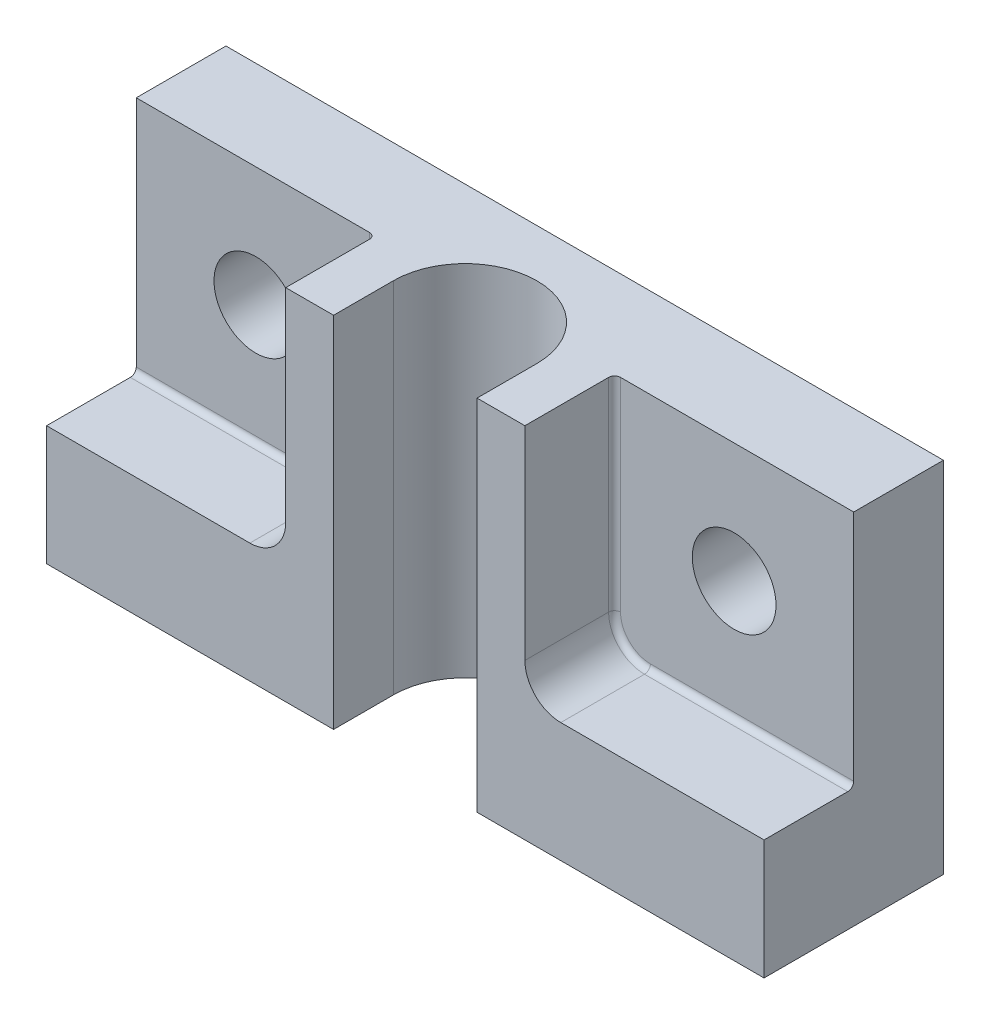
ISO-10303-21;
HEADER;
FILE_DESCRIPTION(('STEP AP214'),'2;1');
FILE_NAME('part.step','',(''),(''),'','','');
FILE_SCHEMA(('AUTOMOTIVE_DESIGN { 1 0 10303 214 1 1 1 1 }'));
ENDSEC;
DATA;
#1=APPLICATION_CONTEXT('core data for automotive mechanical design processes');
#2=APPLICATION_PROTOCOL_DEFINITION('international standard','automotive_design',2000,#1);
#3=PRODUCT_CONTEXT('',#1,'mechanical');
#4=PRODUCT('Part','Part','',(#3));
#5=PRODUCT_RELATED_PRODUCT_CATEGORY('part','',(#4));
#6=PRODUCT_DEFINITION_FORMATION('','',#4);
#7=PRODUCT_DEFINITION_CONTEXT('part definition',#1,'design');
#8=PRODUCT_DEFINITION('design','',#6,#7);
#9=PRODUCT_DEFINITION_SHAPE('','',#8);
#10=(LENGTH_UNIT() NAMED_UNIT(*) SI_UNIT(.MILLI.,.METRE.));
#11=(NAMED_UNIT(*) PLANE_ANGLE_UNIT() SI_UNIT($,.RADIAN.));
#12=(NAMED_UNIT(*) SI_UNIT($,.STERADIAN.) SOLID_ANGLE_UNIT());
#13=UNCERTAINTY_MEASURE_WITH_UNIT(LENGTH_MEASURE(1.E-05),#10,'distance_accuracy_value','');
#14=(GEOMETRIC_REPRESENTATION_CONTEXT(3) GLOBAL_UNCERTAINTY_ASSIGNED_CONTEXT((#13)) GLOBAL_UNIT_ASSIGNED_CONTEXT((#10,
#11,#12)) REPRESENTATION_CONTEXT('',''));
#15=CARTESIAN_POINT('',(0.,0.,0.));
#16=DIRECTION('',(0.,0.,1.));
#17=DIRECTION('',(1.,0.,0.));
#18=AXIS2_PLACEMENT_3D('',#15,#16,#17);
#19=CARTESIAN_POINT('',(-30.,-30.,0.));
#20=DIRECTION('',(0.,0.,1.));
#21=DIRECTION('',(1.,0.,0.));
#22=AXIS2_PLACEMENT_3D('',#19,#20,#21);
#23=PLANE('',#22);
#24=DIRECTION('',(0.,1.,0.));
#25=VECTOR('',#24,1.);
#26=CARTESIAN_POINT('',(-6.,-30.,0.));
#27=LINE('',#26,#25);
#28=CARTESIAN_POINT('',(-6.,-30.,0.));
#29=VERTEX_POINT('',#28);
#30=CARTESIAN_POINT('',(-6.,0.,0.));
#31=VERTEX_POINT('',#30);
#32=EDGE_CURVE('E213',#29,#31,#27,.T.);
#33=ORIENTED_EDGE('',*,*,#32,.T.);
#34=DIRECTION('',(-1.,0.,0.));
#35=VECTOR('',#34,1.);
#36=CARTESIAN_POINT('',(-30.,0.,0.));
#37=LINE('',#36,#35);
#38=CARTESIAN_POINT('',(-10.,0.,0.));
#39=VERTEX_POINT('',#38);
#40=EDGE_CURVE('E292',#31,#39,#37,.T.);
#41=ORIENTED_EDGE('',*,*,#40,.T.);
#42=DIRECTION('',(0.,1.,0.));
#43=VECTOR('',#42,1.);
#44=CARTESIAN_POINT('',(-10.,-17.,0.));
#45=LINE('',#44,#43);
#46=CARTESIAN_POINT('',(-10.,-17.,0.));
#47=VERTEX_POINT('',#46);
#48=EDGE_CURVE('E228',#47,#39,#45,.T.);
#49=ORIENTED_EDGE('',*,*,#48,.F.);
#50=CARTESIAN_POINT('',(-13.,-17.,0.));
#51=DIRECTION('',(0.,0.,1.));
#52=DIRECTION('',(1.,0.,0.));
#53=AXIS2_PLACEMENT_3D('',#50,#51,#52);
#54=CIRCLE('',#53,3.);
#55=CARTESIAN_POINT('',(-13.,-20.,0.));
#56=VERTEX_POINT('',#55);
#57=EDGE_CURVE('E216',#56,#47,#54,.T.);
#58=ORIENTED_EDGE('',*,*,#57,.F.);
#59=DIRECTION('',(1.,0.,0.));
#60=VECTOR('',#59,1.);
#61=CARTESIAN_POINT('',(-13.,-20.,0.));
#62=LINE('',#61,#60);
#63=CARTESIAN_POINT('',(-30.,-20.,0.));
#64=VERTEX_POINT('',#63);
#65=EDGE_CURVE('E222',#64,#56,#62,.T.);
#66=ORIENTED_EDGE('',*,*,#65,.F.);
#67=DIRECTION('',(0.,-1.,0.));
#68=VECTOR('',#67,1.);
#69=CARTESIAN_POINT('',(-30.,0.,0.));
#70=LINE('',#69,#68);
#71=CARTESIAN_POINT('',(-30.,-30.,0.));
#72=VERTEX_POINT('',#71);
#73=EDGE_CURVE('E270',#64,#72,#70,.T.);
#74=ORIENTED_EDGE('',*,*,#73,.T.);
#75=DIRECTION('',(1.,0.,0.));
#76=VECTOR('',#75,1.);
#77=CARTESIAN_POINT('',(-30.,-30.,0.));
#78=LINE('',#77,#76);
#79=EDGE_CURVE('E286',#72,#29,#78,.T.);
#80=ORIENTED_EDGE('',*,*,#79,.T.);
#81=EDGE_LOOP('',(#33,#41,#49,#58,#66,#74,#80));
#82=FACE_BOUND('',#81,.T.);
#83=ADVANCED_FACE('F40',(#82),#23,.T.);
#84=CARTESIAN_POINT('',(-20.,-10.0000000000003,-15.));
#85=DIRECTION('',(0.,0.,1.));
#86=DIRECTION('',(1.,0.,0.));
#87=AXIS2_PLACEMENT_3D('',#84,#85,#86);
#88=CYLINDRICAL_SURFACE('',#87,3.5);
#89=CARTESIAN_POINT('',(-20.,-10.0000000000003,-15.));
#90=DIRECTION('',(0.,0.,1.));
#91=DIRECTION('',(1.,0.,0.));
#92=AXIS2_PLACEMENT_3D('',#89,#90,#91);
#93=CIRCLE('',#92,3.5);
#94=CARTESIAN_POINT('',(-16.5,-10.0000000000003,-15.));
#95=VERTEX_POINT('',#94);
#96=EDGE_CURVE('E264',#95,#95,#93,.T.);
#97=ORIENTED_EDGE('',*,*,#96,.F.);
#98=EDGE_LOOP('',(#97));
#99=FACE_BOUND('',#98,.T.);
#100=CARTESIAN_POINT('',(-20.,-10.0000000000003,-7.5));
#101=DIRECTION('',(0.,0.,1.));
#102=DIRECTION('',(1.,0.,0.));
#103=AXIS2_PLACEMENT_3D('',#100,#101,#102);
#104=CIRCLE('',#103,3.5);
#105=CARTESIAN_POINT('',(-16.5,-10.0000000000003,-7.5));
#106=VERTEX_POINT('',#105);
#107=EDGE_CURVE('E235',#106,#106,#104,.F.);
#108=ORIENTED_EDGE('',*,*,#107,.F.);
#109=EDGE_LOOP('',(#108));
#110=FACE_BOUND('',#109,.T.);
#111=ADVANCED_FACE('F436',(#99,#110),#88,.F.);
#112=CARTESIAN_POINT('',(-30.,0.,-15.));
#113=DIRECTION('',(-1.,0.,0.));
#114=DIRECTION('',(0.,-1.,0.));
#115=AXIS2_PLACEMENT_3D('',#112,#113,#114);
#116=PLANE('',#115);
#117=DIRECTION('',(0.,0.,1.));
#118=VECTOR('',#117,1.);
#119=CARTESIAN_POINT('',(-30.,-20.,-7.5));
#120=LINE('',#119,#118);
#121=CARTESIAN_POINT('',(-30.,-20.,-7.));
#122=VERTEX_POINT('',#121);
#123=EDGE_CURVE('E236',#122,#64,#120,.T.);
#124=ORIENTED_EDGE('',*,*,#123,.F.);
#125=CARTESIAN_POINT('',(-30.,-19.5,-7.));
#126=DIRECTION('',(-1.,0.,0.));
#127=DIRECTION('',(0.,-1.,0.));
#128=AXIS2_PLACEMENT_3D('',#125,#126,#127);
#129=CIRCLE('',#128,0.5);
#130=CARTESIAN_POINT('',(-30.,-19.5,-7.5));
#131=VERTEX_POINT('',#130);
#132=EDGE_CURVE('E49',#122,#131,#129,.F.);
#133=ORIENTED_EDGE('',*,*,#132,.T.);
#134=DIRECTION('',(0.,-1.,0.));
#135=VECTOR('',#134,1.);
#136=CARTESIAN_POINT('',(-30.,-20.,-7.5));
#137=LINE('',#136,#135);
#138=CARTESIAN_POINT('',(-30.,0.,-7.5));
#139=VERTEX_POINT('',#138);
#140=EDGE_CURVE('E221',#139,#131,#137,.T.);
#141=ORIENTED_EDGE('',*,*,#140,.F.);
#142=DIRECTION('',(0.,0.,1.));
#143=VECTOR('',#142,1.);
#144=CARTESIAN_POINT('',(-30.,0.,-15.));
#145=LINE('',#144,#143);
#146=CARTESIAN_POINT('',(-30.,0.,-15.));
#147=VERTEX_POINT('',#146);
#148=EDGE_CURVE('E295',#147,#139,#145,.T.);
#149=ORIENTED_EDGE('',*,*,#148,.F.);
#150=DIRECTION('',(0.,-1.,0.));
#151=VECTOR('',#150,1.);
#152=CARTESIAN_POINT('',(-30.,0.,-15.));
#153=LINE('',#152,#151);
#154=CARTESIAN_POINT('',(-30.,-30.,-15.));
#155=VERTEX_POINT('',#154);
#156=EDGE_CURVE('E271',#147,#155,#153,.T.);
#157=ORIENTED_EDGE('',*,*,#156,.T.);
#158=DIRECTION('',(0.,0.,1.));
#159=VECTOR('',#158,1.);
#160=CARTESIAN_POINT('',(-30.,-30.,-15.));
#161=LINE('',#160,#159);
#162=EDGE_CURVE('E284',#155,#72,#161,.T.);
#163=ORIENTED_EDGE('',*,*,#162,.T.);
#164=ORIENTED_EDGE('',*,*,#73,.F.);
#165=EDGE_LOOP('',(#124,#133,#141,#149,#157,#163,#164));
#166=FACE_BOUND('',#165,.T.);
#167=ADVANCED_FACE('F391',(#166),#116,.T.);
#168=CARTESIAN_POINT('',(-30.,0.,-15.));
#169=DIRECTION('',(0.,1.,0.));
#170=DIRECTION('',(0.,0.,1.));
#171=AXIS2_PLACEMENT_3D('',#168,#169,#170);
#172=PLANE('',#171);
#173=DIRECTION('',(0.,0.,1.));
#174=VECTOR('',#173,1.);
#175=CARTESIAN_POINT('',(-6.,0.,0.));
#176=LINE('',#175,#174);
#177=CARTESIAN_POINT('',(-6.,0.,-5.));
#178=VERTEX_POINT('',#177);
#179=EDGE_CURVE('E204',#178,#31,#176,.T.);
#180=ORIENTED_EDGE('',*,*,#179,.F.);
#181=CARTESIAN_POINT('',(0.,0.,-5.));
#182=DIRECTION('',(0.,1.,0.));
#183=DIRECTION('',(0.,0.,1.));
#184=AXIS2_PLACEMENT_3D('',#181,#182,#183);
#185=CIRCLE('',#184,6.);
#186=CARTESIAN_POINT('',(6.,0.,-5.));
#187=VERTEX_POINT('',#186);
#188=EDGE_CURVE('E206',#187,#178,#185,.T.);
#189=ORIENTED_EDGE('',*,*,#188,.F.);
#190=DIRECTION('',(0.,0.,-1.));
#191=VECTOR('',#190,1.);
#192=CARTESIAN_POINT('',(6.,0.,0.));
#193=LINE('',#192,#191);
#194=CARTESIAN_POINT('',(6.,0.,0.));
#195=VERTEX_POINT('',#194);
#196=EDGE_CURVE('E185',#195,#187,#193,.T.);
#197=ORIENTED_EDGE('',*,*,#196,.F.);
#198=CARTESIAN_POINT('',(10.,0.,0.));
#199=VERTEX_POINT('',#198);
#200=EDGE_CURVE('E275',#199,#195,#37,.T.);
#201=ORIENTED_EDGE('',*,*,#200,.F.);
#202=DIRECTION('',(0.,0.,1.));
#203=VECTOR('',#202,1.);
#204=CARTESIAN_POINT('',(10.,0.,-7.5));
#205=LINE('',#204,#203);
#206=CARTESIAN_POINT('',(10.,0.,-7.));
#207=VERTEX_POINT('',#206);
#208=EDGE_CURVE('E247',#207,#199,#205,.T.);
#209=ORIENTED_EDGE('',*,*,#208,.F.);
#210=CARTESIAN_POINT('',(10.5,0.,-7.));
#211=DIRECTION('',(0.,1.,0.));
#212=DIRECTION('',(0.,0.,1.));
#213=AXIS2_PLACEMENT_3D('',#210,#211,#212);
#214=CIRCLE('',#213,0.5);
#215=CARTESIAN_POINT('',(10.5,0.,-7.5));
#216=VERTEX_POINT('',#215);
#217=EDGE_CURVE('E336',#207,#216,#214,.F.);
#218=ORIENTED_EDGE('',*,*,#217,.T.);
#219=DIRECTION('',(-1.,0.,0.));
#220=VECTOR('',#219,1.);
#221=CARTESIAN_POINT('',(10.,0.,-7.5));
#222=LINE('',#221,#220);
#223=CARTESIAN_POINT('',(30.,0.,-7.5));
#224=VERTEX_POINT('',#223);
#225=EDGE_CURVE('E243',#224,#216,#222,.T.);
#226=ORIENTED_EDGE('',*,*,#225,.F.);
#227=DIRECTION('',(0.,0.,1.));
#228=VECTOR('',#227,1.);
#229=CARTESIAN_POINT('',(30.,0.,-15.));
#230=LINE('',#229,#228);
#231=CARTESIAN_POINT('',(30.,0.,-15.));
#232=VERTEX_POINT('',#231);
#233=EDGE_CURVE('E299',#232,#224,#230,.T.);
#234=ORIENTED_EDGE('',*,*,#233,.F.);
#235=DIRECTION('',(-1.,0.,0.));
#236=VECTOR('',#235,1.);
#237=CARTESIAN_POINT('',(-30.,0.,-15.));
#238=LINE('',#237,#236);
#239=EDGE_CURVE('E281',#232,#147,#238,.T.);
#240=ORIENTED_EDGE('',*,*,#239,.T.);
#241=ORIENTED_EDGE('',*,*,#148,.T.);
#242=DIRECTION('',(-1.,0.,0.));
#243=VECTOR('',#242,1.);
#244=CARTESIAN_POINT('',(-10.,0.,-7.5));
#245=LINE('',#244,#243);
#246=CARTESIAN_POINT('',(-10.5,0.,-7.5));
#247=VERTEX_POINT('',#246);
#248=EDGE_CURVE('E219',#247,#139,#245,.T.);
#249=ORIENTED_EDGE('',*,*,#248,.F.);
#250=CARTESIAN_POINT('',(-10.5,0.,-7.));
#251=DIRECTION('',(0.,1.,0.));
#252=DIRECTION('',(0.,0.,1.));
#253=AXIS2_PLACEMENT_3D('',#250,#251,#252);
#254=CIRCLE('',#253,0.5);
#255=CARTESIAN_POINT('',(-10.,0.,-7.));
#256=VERTEX_POINT('',#255);
#257=EDGE_CURVE('E334',#247,#256,#254,.F.);
#258=ORIENTED_EDGE('',*,*,#257,.T.);
#259=DIRECTION('',(0.,0.,1.));
#260=VECTOR('',#259,1.);
#261=CARTESIAN_POINT('',(-10.,0.,-7.5));
#262=LINE('',#261,#260);
#263=EDGE_CURVE('E238',#256,#39,#262,.T.);
#264=ORIENTED_EDGE('',*,*,#263,.T.);
#265=ORIENTED_EDGE('',*,*,#40,.F.);
#266=EDGE_LOOP('',(#180,#189,#197,#201,#209,#218,#226,#234,#240,#241,#249,#258,#264,#265));
#267=FACE_BOUND('',#266,.T.);
#268=ADVANCED_FACE('F366',(#267),#172,.T.);
#269=CARTESIAN_POINT('',(30.,0.,-15.));
#270=DIRECTION('',(1.,0.,0.));
#271=DIRECTION('',(0.,1.,0.));
#272=AXIS2_PLACEMENT_3D('',#269,#270,#271);
#273=PLANE('',#272);
#274=DIRECTION('',(0.,1.,0.));
#275=VECTOR('',#274,1.);
#276=CARTESIAN_POINT('',(30.,-20.,-7.5));
#277=LINE('',#276,#275);
#278=CARTESIAN_POINT('',(30.,-19.5,-7.5));
#279=VERTEX_POINT('',#278);
#280=EDGE_CURVE('E241',#279,#224,#277,.T.);
#281=ORIENTED_EDGE('',*,*,#280,.F.);
#282=CARTESIAN_POINT('',(30.,-19.5,-7.));
#283=DIRECTION('',(1.,0.,0.));
#284=DIRECTION('',(0.,1.,0.));
#285=AXIS2_PLACEMENT_3D('',#282,#283,#284);
#286=CIRCLE('',#285,0.5);
#287=CARTESIAN_POINT('',(30.,-20.,-7.));
#288=VERTEX_POINT('',#287);
#289=EDGE_CURVE('E11',#279,#288,#286,.F.);
#290=ORIENTED_EDGE('',*,*,#289,.T.);
#291=DIRECTION('',(0.,0.,1.));
#292=VECTOR('',#291,1.);
#293=CARTESIAN_POINT('',(30.,-20.,-7.5));
#294=LINE('',#293,#292);
#295=CARTESIAN_POINT('',(30.,-20.,0.));
#296=VERTEX_POINT('',#295);
#297=EDGE_CURVE('E256',#288,#296,#294,.T.);
#298=ORIENTED_EDGE('',*,*,#297,.T.);
#299=DIRECTION('',(0.,1.,0.));
#300=VECTOR('',#299,1.);
#301=CARTESIAN_POINT('',(30.,0.,0.));
#302=LINE('',#301,#300);
#303=CARTESIAN_POINT('',(30.,-30.,0.));
#304=VERTEX_POINT('',#303);
#305=EDGE_CURVE('E289',#304,#296,#302,.T.);
#306=ORIENTED_EDGE('',*,*,#305,.F.);
#307=DIRECTION('',(0.,0.,1.));
#308=VECTOR('',#307,1.);
#309=CARTESIAN_POINT('',(30.,-30.,-15.));
#310=LINE('',#309,#308);
#311=CARTESIAN_POINT('',(30.,-30.,-15.));
#312=VERTEX_POINT('',#311);
#313=EDGE_CURVE('E302',#312,#304,#310,.T.);
#314=ORIENTED_EDGE('',*,*,#313,.F.);
#315=DIRECTION('',(0.,1.,0.));
#316=VECTOR('',#315,1.);
#317=CARTESIAN_POINT('',(30.,0.,-15.));
#318=LINE('',#317,#316);
#319=EDGE_CURVE('E278',#312,#232,#318,.T.);
#320=ORIENTED_EDGE('',*,*,#319,.T.);
#321=ORIENTED_EDGE('',*,*,#233,.T.);
#322=EDGE_LOOP('',(#281,#290,#298,#306,#314,#320,#321));
#323=FACE_BOUND('',#322,.T.);
#324=ADVANCED_FACE('F361',(#323),#273,.T.);
#325=CARTESIAN_POINT('',(-30.,-30.,-15.));
#326=DIRECTION('',(0.,-1.,0.));
#327=DIRECTION('',(0.,0.,-1.));
#328=AXIS2_PLACEMENT_3D('',#325,#326,#327);
#329=PLANE('',#328);
#330=DIRECTION('',(0.,0.,1.));
#331=VECTOR('',#330,1.);
#332=CARTESIAN_POINT('',(-6.,-30.,0.));
#333=LINE('',#332,#331);
#334=CARTESIAN_POINT('',(-6.,-30.,-5.));
#335=VERTEX_POINT('',#334);
#336=EDGE_CURVE('E198',#335,#29,#333,.T.);
#337=ORIENTED_EDGE('',*,*,#336,.T.);
#338=ORIENTED_EDGE('',*,*,#79,.F.);
#339=ORIENTED_EDGE('',*,*,#162,.F.);
#340=DIRECTION('',(1.,0.,0.));
#341=VECTOR('',#340,1.);
#342=CARTESIAN_POINT('',(-30.,-30.,-15.));
#343=LINE('',#342,#341);
#344=EDGE_CURVE('E274',#155,#312,#343,.T.);
#345=ORIENTED_EDGE('',*,*,#344,.T.);
#346=ORIENTED_EDGE('',*,*,#313,.T.);
#347=CARTESIAN_POINT('',(5.99999999999999,-30.,0.));
#348=VERTEX_POINT('',#347);
#349=EDGE_CURVE('E203',#348,#304,#78,.T.);
#350=ORIENTED_EDGE('',*,*,#349,.F.);
#351=DIRECTION('',(0.,0.,-1.));
#352=VECTOR('',#351,1.);
#353=CARTESIAN_POINT('',(6.,-30.,0.));
#354=LINE('',#353,#352);
#355=CARTESIAN_POINT('',(6.,-30.,-5.));
#356=VERTEX_POINT('',#355);
#357=EDGE_CURVE('E182',#348,#356,#354,.T.);
#358=ORIENTED_EDGE('',*,*,#357,.T.);
#359=CARTESIAN_POINT('',(0.,-30.,-5.));
#360=DIRECTION('',(0.,1.,0.));
#361=DIRECTION('',(0.,0.,1.));
#362=AXIS2_PLACEMENT_3D('',#359,#360,#361);
#363=CIRCLE('',#362,6.);
#364=EDGE_CURVE('E193',#356,#335,#363,.T.);
#365=ORIENTED_EDGE('',*,*,#364,.T.);
#366=EDGE_LOOP('',(#337,#338,#339,#345,#346,#350,#358,#365));
#367=FACE_BOUND('',#366,.T.);
#368=ADVANCED_FACE('F201',(#367),#329,.T.);
#369=CARTESIAN_POINT('',(-30.,-30.,-15.));
#370=DIRECTION('',(0.,0.,1.));
#371=DIRECTION('',(1.,0.,0.));
#372=AXIS2_PLACEMENT_3D('',#369,#370,#371);
#373=PLANE('',#372);
#374=ORIENTED_EDGE('',*,*,#96,.T.);
#375=EDGE_LOOP('',(#374));
#376=FACE_BOUND('',#375,.T.);
#377=CARTESIAN_POINT('',(20.,-10.,-15.));
#378=DIRECTION('',(0.,0.,1.));
#379=DIRECTION('',(1.,0.,0.));
#380=AXIS2_PLACEMENT_3D('',#377,#378,#379);
#381=CIRCLE('',#380,3.5);
#382=CARTESIAN_POINT('',(23.5,-10.,-15.));
#383=VERTEX_POINT('',#382);
#384=EDGE_CURVE('E267',#383,#383,#381,.T.);
#385=ORIENTED_EDGE('',*,*,#384,.T.);
#386=EDGE_LOOP('',(#385));
#387=FACE_BOUND('',#386,.T.);
#388=ORIENTED_EDGE('',*,*,#156,.F.);
#389=ORIENTED_EDGE('',*,*,#239,.F.);
#390=ORIENTED_EDGE('',*,*,#319,.F.);
#391=ORIENTED_EDGE('',*,*,#344,.F.);
#392=EDGE_LOOP('',(#388,#389,#390,#391));
#393=FACE_BOUND('',#392,.T.);
#394=ADVANCED_FACE('F389',(#376,#387,#393),#373,.F.);
#395=DIRECTION('',(0.,1.,0.));
#396=VECTOR('',#395,1.);
#397=CARTESIAN_POINT('',(6.,-30.,0.));
#398=LINE('',#397,#396);
#399=EDGE_CURVE('E190',#348,#195,#398,.T.);
#400=ORIENTED_EDGE('',*,*,#399,.F.);
#401=ORIENTED_EDGE('',*,*,#349,.T.);
#402=ORIENTED_EDGE('',*,*,#305,.T.);
#403=DIRECTION('',(1.,0.,0.));
#404=VECTOR('',#403,1.);
#405=CARTESIAN_POINT('',(13.,-20.,0.));
#406=LINE('',#405,#404);
#407=CARTESIAN_POINT('',(13.,-20.,0.));
#408=VERTEX_POINT('',#407);
#409=EDGE_CURVE('E244',#408,#296,#406,.T.);
#410=ORIENTED_EDGE('',*,*,#409,.F.);
#411=CARTESIAN_POINT('',(13.,-17.,0.));
#412=DIRECTION('',(0.,0.,1.));
#413=DIRECTION('',(-1.,0.,0.));
#414=AXIS2_PLACEMENT_3D('',#411,#412,#413);
#415=CIRCLE('',#414,3.);
#416=CARTESIAN_POINT('',(10.,-17.,0.));
#417=VERTEX_POINT('',#416);
#418=EDGE_CURVE('E251',#417,#408,#415,.T.);
#419=ORIENTED_EDGE('',*,*,#418,.F.);
#420=DIRECTION('',(0.,-1.,0.));
#421=VECTOR('',#420,1.);
#422=CARTESIAN_POINT('',(10.,-17.,0.));
#423=LINE('',#422,#421);
#424=EDGE_CURVE('E248',#199,#417,#423,.T.);
#425=ORIENTED_EDGE('',*,*,#424,.F.);
#426=ORIENTED_EDGE('',*,*,#200,.T.);
#427=EDGE_LOOP('',(#400,#401,#402,#410,#419,#425,#426));
#428=FACE_BOUND('',#427,.T.);
#429=ADVANCED_FACE('F376',(#428),#23,.T.);
#430=CARTESIAN_POINT('',(20.,-10.,-15.));
#431=DIRECTION('',(0.,0.,1.));
#432=DIRECTION('',(1.,0.,0.));
#433=AXIS2_PLACEMENT_3D('',#430,#431,#432);
#434=CYLINDRICAL_SURFACE('',#433,3.5);
#435=CARTESIAN_POINT('',(20.,-10.,-7.5));
#436=DIRECTION('',(0.,0.,-1.));
#437=DIRECTION('',(-1.,0.,0.));
#438=AXIS2_PLACEMENT_3D('',#435,#436,#437);
#439=CIRCLE('',#438,3.5);
#440=CARTESIAN_POINT('',(16.5,-10.,-7.5));
#441=VERTEX_POINT('',#440);
#442=EDGE_CURVE('E258',#441,#441,#439,.F.);
#443=ORIENTED_EDGE('',*,*,#442,.T.);
#444=EDGE_LOOP('',(#443));
#445=FACE_BOUND('',#444,.T.);
#446=ORIENTED_EDGE('',*,*,#384,.F.);
#447=EDGE_LOOP('',(#446));
#448=FACE_BOUND('',#447,.T.);
#449=ADVANCED_FACE('F446',(#445,#448),#434,.F.);
#450=CARTESIAN_POINT('',(13.,-17.,-7.5));
#451=DIRECTION('',(0.,0.,-1.));
#452=DIRECTION('',(-1.,0.,0.));
#453=AXIS2_PLACEMENT_3D('',#450,#451,#452);
#454=PLANE('',#453);
#455=ORIENTED_EDGE('',*,*,#225,.T.);
#456=DIRECTION('',(0.,-1.,0.));
#457=VECTOR('',#456,1.);
#458=CARTESIAN_POINT('',(10.5,-17.,-7.5));
#459=LINE('',#458,#457);
#460=CARTESIAN_POINT('',(10.5,-17.,-7.5));
#461=VERTEX_POINT('',#460);
#462=EDGE_CURVE('E324',#216,#461,#459,.T.);
#463=ORIENTED_EDGE('',*,*,#462,.T.);
#464=CARTESIAN_POINT('',(13.,-17.,-7.5));
#465=DIRECTION('',(0.,0.,-1.));
#466=DIRECTION('',(-1.,0.,0.));
#467=AXIS2_PLACEMENT_3D('',#464,#465,#466);
#468=CIRCLE('',#467,2.5);
#469=CARTESIAN_POINT('',(13.,-19.5,-7.5));
#470=VERTEX_POINT('',#469);
#471=EDGE_CURVE('E322',#461,#470,#468,.F.);
#472=ORIENTED_EDGE('',*,*,#471,.T.);
#473=DIRECTION('',(1.,0.,0.));
#474=VECTOR('',#473,1.);
#475=CARTESIAN_POINT('',(30.,-19.5,-7.5));
#476=LINE('',#475,#474);
#477=EDGE_CURVE('E320',#470,#279,#476,.T.);
#478=ORIENTED_EDGE('',*,*,#477,.T.);
#479=ORIENTED_EDGE('',*,*,#280,.T.);
#480=EDGE_LOOP('',(#455,#463,#472,#478,#479));
#481=FACE_BOUND('',#480,.T.);
#482=ORIENTED_EDGE('',*,*,#442,.F.);
#483=EDGE_LOOP('',(#482));
#484=FACE_BOUND('',#483,.T.);
#485=ADVANCED_FACE('F358',(#481,#484),#454,.F.);
#486=CARTESIAN_POINT('',(13.,-20.,-7.5));
#487=DIRECTION('',(0.,-1.,0.));
#488=DIRECTION('',(0.,0.,-1.));
#489=AXIS2_PLACEMENT_3D('',#486,#487,#488);
#490=PLANE('',#489);
#491=ORIENTED_EDGE('',*,*,#297,.F.);
#492=DIRECTION('',(1.,0.,0.));
#493=VECTOR('',#492,1.);
#494=CARTESIAN_POINT('',(13.,-20.,-7.));
#495=LINE('',#494,#493);
#496=CARTESIAN_POINT('',(13.,-20.,-7.));
#497=VERTEX_POINT('',#496);
#498=EDGE_CURVE('E332',#288,#497,#495,.F.);
#499=ORIENTED_EDGE('',*,*,#498,.T.);
#500=DIRECTION('',(0.,0.,1.));
#501=VECTOR('',#500,1.);
#502=CARTESIAN_POINT('',(13.,-20.,-7.5));
#503=LINE('',#502,#501);
#504=EDGE_CURVE('E259',#497,#408,#503,.T.);
#505=ORIENTED_EDGE('',*,*,#504,.T.);
#506=ORIENTED_EDGE('',*,*,#409,.T.);
#507=EDGE_LOOP('',(#491,#499,#505,#506));
#508=FACE_BOUND('',#507,.T.);
#509=ADVANCED_FACE('F383',(#508),#490,.F.);
#510=CARTESIAN_POINT('',(13.,-17.,-7.5));
#511=DIRECTION('',(0.,0.,1.));
#512=DIRECTION('',(1.,0.,0.));
#513=AXIS2_PLACEMENT_3D('',#510,#511,#512);
#514=CYLINDRICAL_SURFACE('',#513,3.);
#515=ORIENTED_EDGE('',*,*,#504,.F.);
#516=CARTESIAN_POINT('',(13.,-17.,-7.));
#517=DIRECTION('',(0.,0.,-1.));
#518=DIRECTION('',(-1.,0.,0.));
#519=AXIS2_PLACEMENT_3D('',#516,#517,#518);
#520=CIRCLE('',#519,3.);
#521=CARTESIAN_POINT('',(10.,-17.,-7.));
#522=VERTEX_POINT('',#521);
#523=EDGE_CURVE('E329',#497,#522,#520,.T.);
#524=ORIENTED_EDGE('',*,*,#523,.T.);
#525=DIRECTION('',(0.,0.,1.));
#526=VECTOR('',#525,1.);
#527=CARTESIAN_POINT('',(10.,-17.,-7.5));
#528=LINE('',#527,#526);
#529=EDGE_CURVE('E261',#522,#417,#528,.T.);
#530=ORIENTED_EDGE('',*,*,#529,.T.);
#531=ORIENTED_EDGE('',*,*,#418,.T.);
#532=EDGE_LOOP('',(#515,#524,#530,#531));
#533=FACE_BOUND('',#532,.T.);
#534=ADVANCED_FACE('F381',(#533),#514,.F.);
#535=CARTESIAN_POINT('',(10.,-17.,-7.5));
#536=DIRECTION('',(-1.,0.,0.));
#537=DIRECTION('',(0.,0.,1.));
#538=AXIS2_PLACEMENT_3D('',#535,#536,#537);
#539=PLANE('',#538);
#540=ORIENTED_EDGE('',*,*,#529,.F.);
#541=DIRECTION('',(0.,-1.,0.));
#542=VECTOR('',#541,1.);
#543=CARTESIAN_POINT('',(10.,0.,-7.));
#544=LINE('',#543,#542);
#545=EDGE_CURVE('E327',#522,#207,#544,.F.);
#546=ORIENTED_EDGE('',*,*,#545,.T.);
#547=ORIENTED_EDGE('',*,*,#208,.T.);
#548=ORIENTED_EDGE('',*,*,#424,.T.);
#549=EDGE_LOOP('',(#540,#546,#547,#548));
#550=FACE_BOUND('',#549,.T.);
#551=ADVANCED_FACE('F372',(#550),#539,.F.);
#552=CARTESIAN_POINT('',(-13.,-17.,-7.5));
#553=DIRECTION('',(0.,0.,1.));
#554=DIRECTION('',(1.,0.,0.));
#555=AXIS2_PLACEMENT_3D('',#552,#553,#554);
#556=PLANE('',#555);
#557=CARTESIAN_POINT('',(-13.,-17.,-7.5));
#558=DIRECTION('',(0.,0.,1.));
#559=DIRECTION('',(1.,0.,0.));
#560=AXIS2_PLACEMENT_3D('',#557,#558,#559);
#561=CIRCLE('',#560,2.5);
#562=CARTESIAN_POINT('',(-13.,-19.5,-7.5));
#563=VERTEX_POINT('',#562);
#564=CARTESIAN_POINT('',(-10.5,-17.,-7.5));
#565=VERTEX_POINT('',#564);
#566=EDGE_CURVE('E311',#563,#565,#561,.T.);
#567=ORIENTED_EDGE('',*,*,#566,.T.);
#568=DIRECTION('',(0.,1.,0.));
#569=VECTOR('',#568,1.);
#570=CARTESIAN_POINT('',(-10.5,-17.,-7.5));
#571=LINE('',#570,#569);
#572=EDGE_CURVE('E313',#565,#247,#571,.T.);
#573=ORIENTED_EDGE('',*,*,#572,.T.);
#574=ORIENTED_EDGE('',*,*,#248,.T.);
#575=ORIENTED_EDGE('',*,*,#140,.T.);
#576=DIRECTION('',(1.,0.,0.));
#577=VECTOR('',#576,1.);
#578=CARTESIAN_POINT('',(-13.,-19.5,-7.5));
#579=LINE('',#578,#577);
#580=EDGE_CURVE('E298',#131,#563,#579,.T.);
#581=ORIENTED_EDGE('',*,*,#580,.T.);
#582=EDGE_LOOP('',(#567,#573,#574,#575,#581));
#583=FACE_BOUND('',#582,.T.);
#584=ORIENTED_EDGE('',*,*,#107,.T.);
#585=EDGE_LOOP('',(#584));
#586=FACE_BOUND('',#585,.T.);
#587=ADVANCED_FACE('F397',(#583,#586),#556,.T.);
#588=CARTESIAN_POINT('',(-13.,-17.,-7.5));
#589=DIRECTION('',(0.,0.,1.));
#590=DIRECTION('',(1.,0.,0.));
#591=AXIS2_PLACEMENT_3D('',#588,#589,#590);
#592=CYLINDRICAL_SURFACE('',#591,3.);
#593=DIRECTION('',(0.,0.,1.));
#594=VECTOR('',#593,1.);
#595=CARTESIAN_POINT('',(-10.,-17.,-7.5));
#596=LINE('',#595,#594);
#597=CARTESIAN_POINT('',(-10.,-17.,-7.));
#598=VERTEX_POINT('',#597);
#599=EDGE_CURVE('E225',#598,#47,#596,.T.);
#600=ORIENTED_EDGE('',*,*,#599,.F.);
#601=CARTESIAN_POINT('',(-13.,-17.,-7.));
#602=DIRECTION('',(0.,0.,1.));
#603=DIRECTION('',(1.,0.,0.));
#604=AXIS2_PLACEMENT_3D('',#601,#602,#603);
#605=CIRCLE('',#604,3.);
#606=CARTESIAN_POINT('',(-13.,-20.,-7.));
#607=VERTEX_POINT('',#606);
#608=EDGE_CURVE('E318',#598,#607,#605,.F.);
#609=ORIENTED_EDGE('',*,*,#608,.T.);
#610=DIRECTION('',(0.,0.,1.));
#611=VECTOR('',#610,1.);
#612=CARTESIAN_POINT('',(-13.,-20.,-7.5));
#613=LINE('',#612,#611);
#614=EDGE_CURVE('E233',#607,#56,#613,.T.);
#615=ORIENTED_EDGE('',*,*,#614,.T.);
#616=ORIENTED_EDGE('',*,*,#57,.T.);
#617=EDGE_LOOP('',(#600,#609,#615,#616));
#618=FACE_BOUND('',#617,.T.);
#619=ADVANCED_FACE('F411',(#618),#592,.F.);
#620=CARTESIAN_POINT('',(-13.,-20.,-7.5));
#621=DIRECTION('',(0.,-1.,0.));
#622=DIRECTION('',(0.,0.,-1.));
#623=AXIS2_PLACEMENT_3D('',#620,#621,#622);
#624=PLANE('',#623);
#625=ORIENTED_EDGE('',*,*,#614,.F.);
#626=DIRECTION('',(1.,0.,0.));
#627=VECTOR('',#626,1.);
#628=CARTESIAN_POINT('',(-13.,-20.,-7.));
#629=LINE('',#628,#627);
#630=EDGE_CURVE('E63',#607,#122,#629,.F.);
#631=ORIENTED_EDGE('',*,*,#630,.T.);
#632=ORIENTED_EDGE('',*,*,#123,.T.);
#633=ORIENTED_EDGE('',*,*,#65,.T.);
#634=EDGE_LOOP('',(#625,#631,#632,#633));
#635=FACE_BOUND('',#634,.T.);
#636=ADVANCED_FACE('F421',(#635),#624,.F.);
#637=CARTESIAN_POINT('',(-10.,-17.,-7.5));
#638=DIRECTION('',(1.,0.,0.));
#639=DIRECTION('',(0.,0.,-1.));
#640=AXIS2_PLACEMENT_3D('',#637,#638,#639);
#641=PLANE('',#640);
#642=ORIENTED_EDGE('',*,*,#263,.F.);
#643=DIRECTION('',(0.,1.,0.));
#644=VECTOR('',#643,1.);
#645=CARTESIAN_POINT('',(-10.,-17.,-7.));
#646=LINE('',#645,#644);
#647=EDGE_CURVE('E316',#256,#598,#646,.F.);
#648=ORIENTED_EDGE('',*,*,#647,.T.);
#649=ORIENTED_EDGE('',*,*,#599,.T.);
#650=ORIENTED_EDGE('',*,*,#48,.T.);
#651=EDGE_LOOP('',(#642,#648,#649,#650));
#652=FACE_BOUND('',#651,.T.);
#653=ADVANCED_FACE('F408',(#652),#641,.F.);
#654=CARTESIAN_POINT('',(-6.,-30.,0.));
#655=DIRECTION('',(-1.,0.,0.));
#656=DIRECTION('',(0.,0.,1.));
#657=AXIS2_PLACEMENT_3D('',#654,#655,#656);
#658=PLANE('',#657);
#659=ORIENTED_EDGE('',*,*,#179,.T.);
#660=ORIENTED_EDGE('',*,*,#32,.F.);
#661=ORIENTED_EDGE('',*,*,#336,.F.);
#662=DIRECTION('',(0.,1.,0.));
#663=VECTOR('',#662,1.);
#664=CARTESIAN_POINT('',(-6.,-30.,-5.));
#665=LINE('',#664,#663);
#666=EDGE_CURVE('E189',#335,#178,#665,.T.);
#667=ORIENTED_EDGE('',*,*,#666,.T.);
#668=EDGE_LOOP('',(#659,#660,#661,#667));
#669=FACE_BOUND('',#668,.T.);
#670=ADVANCED_FACE('F426',(#669),#658,.F.);
#671=CARTESIAN_POINT('',(0.,-30.,-5.));
#672=DIRECTION('',(0.,1.,0.));
#673=DIRECTION('',(0.,0.,1.));
#674=AXIS2_PLACEMENT_3D('',#671,#672,#673);
#675=CYLINDRICAL_SURFACE('',#674,6.);
#676=ORIENTED_EDGE('',*,*,#188,.T.);
#677=ORIENTED_EDGE('',*,*,#666,.F.);
#678=ORIENTED_EDGE('',*,*,#364,.F.);
#679=DIRECTION('',(0.,1.,0.));
#680=VECTOR('',#679,1.);
#681=CARTESIAN_POINT('',(6.,-30.,-5.));
#682=LINE('',#681,#680);
#683=EDGE_CURVE('E178',#356,#187,#682,.T.);
#684=ORIENTED_EDGE('',*,*,#683,.T.);
#685=EDGE_LOOP('',(#676,#677,#678,#684));
#686=FACE_BOUND('',#685,.T.);
#687=ADVANCED_FACE('F194',(#686),#675,.F.);
#688=CARTESIAN_POINT('',(6.,-30.,0.));
#689=DIRECTION('',(1.,0.,0.));
#690=DIRECTION('',(0.,0.,-1.));
#691=AXIS2_PLACEMENT_3D('',#688,#689,#690);
#692=PLANE('',#691);
#693=ORIENTED_EDGE('',*,*,#196,.T.);
#694=ORIENTED_EDGE('',*,*,#683,.F.);
#695=ORIENTED_EDGE('',*,*,#357,.F.);
#696=ORIENTED_EDGE('',*,*,#399,.T.);
#697=EDGE_LOOP('',(#693,#694,#695,#696));
#698=FACE_BOUND('',#697,.T.);
#699=ADVANCED_FACE('F180',(#698),#692,.F.);
#700=CARTESIAN_POINT('',(-13.,-19.5,-7.));
#701=DIRECTION('',(1.,0.,0.));
#702=DIRECTION('',(0.,0.,-1.));
#703=AXIS2_PLACEMENT_3D('',#700,#701,#702);
#704=CYLINDRICAL_SURFACE('',#703,0.5);
#705=ORIENTED_EDGE('',*,*,#132,.F.);
#706=ORIENTED_EDGE('',*,*,#630,.F.);
#707=CARTESIAN_POINT('',(-13.,-19.5,-7.));
#708=DIRECTION('',(-1.,0.,0.));
#709=DIRECTION('',(0.,-1.,0.));
#710=AXIS2_PLACEMENT_3D('',#707,#708,#709);
#711=CIRCLE('',#710,0.5);
#712=EDGE_CURVE('E211',#563,#607,#711,.T.);
#713=ORIENTED_EDGE('',*,*,#712,.F.);
#714=ORIENTED_EDGE('',*,*,#580,.F.);
#715=EDGE_LOOP('',(#705,#706,#713,#714));
#716=FACE_BOUND('',#715,.T.);
#717=ADVANCED_FACE('F419',(#716),#704,.F.);
#718=CARTESIAN_POINT('',(-13.,-17.,-7.));
#719=DIRECTION('',(0.,0.,1.));
#720=DIRECTION('',(1.,0.,0.));
#721=AXIS2_PLACEMENT_3D('',#718,#719,#720);
#722=TOROIDAL_SURFACE('',#721,2.5,0.5);
#723=ORIENTED_EDGE('',*,*,#712,.T.);
#724=ORIENTED_EDGE('',*,*,#608,.F.);
#725=CARTESIAN_POINT('',(-10.5,-17.,-7.));
#726=DIRECTION('',(0.,-1.,0.));
#727=DIRECTION('',(0.,0.,-1.));
#728=AXIS2_PLACEMENT_3D('',#725,#726,#727);
#729=CIRCLE('',#728,0.5);
#730=EDGE_CURVE('E339',#565,#598,#729,.T.);
#731=ORIENTED_EDGE('',*,*,#730,.F.);
#732=ORIENTED_EDGE('',*,*,#566,.F.);
#733=EDGE_LOOP('',(#723,#724,#731,#732));
#734=FACE_BOUND('',#733,.T.);
#735=ADVANCED_FACE('F415',(#734),#722,.F.);
#736=CARTESIAN_POINT('',(-10.5,-17.,-7.));
#737=DIRECTION('',(0.,1.,0.));
#738=DIRECTION('',(0.,0.,1.));
#739=AXIS2_PLACEMENT_3D('',#736,#737,#738);
#740=CYLINDRICAL_SURFACE('',#739,0.5);
#741=ORIENTED_EDGE('',*,*,#730,.T.);
#742=ORIENTED_EDGE('',*,*,#647,.F.);
#743=ORIENTED_EDGE('',*,*,#257,.F.);
#744=ORIENTED_EDGE('',*,*,#572,.F.);
#745=EDGE_LOOP('',(#741,#742,#743,#744));
#746=FACE_BOUND('',#745,.T.);
#747=ADVANCED_FACE('F404',(#746),#740,.F.);
#748=CARTESIAN_POINT('',(13.,-19.5,-7.));
#749=DIRECTION('',(-1.,0.,0.));
#750=DIRECTION('',(0.,0.,1.));
#751=AXIS2_PLACEMENT_3D('',#748,#749,#750);
#752=CYLINDRICAL_SURFACE('',#751,0.5);
#753=ORIENTED_EDGE('',*,*,#289,.F.);
#754=ORIENTED_EDGE('',*,*,#477,.F.);
#755=CARTESIAN_POINT('',(13.,-19.5,-7.));
#756=DIRECTION('',(1.,0.,0.));
#757=DIRECTION('',(0.,0.,-1.));
#758=AXIS2_PLACEMENT_3D('',#755,#756,#757);
#759=CIRCLE('',#758,0.5);
#760=EDGE_CURVE('E44',#497,#470,#759,.T.);
#761=ORIENTED_EDGE('',*,*,#760,.F.);
#762=ORIENTED_EDGE('',*,*,#498,.F.);
#763=EDGE_LOOP('',(#753,#754,#761,#762));
#764=FACE_BOUND('',#763,.T.);
#765=ADVANCED_FACE('F42',(#764),#752,.F.);
#766=CARTESIAN_POINT('',(13.,-17.,-7.));
#767=DIRECTION('',(0.,0.,-1.));
#768=DIRECTION('',(-1.,0.,0.));
#769=AXIS2_PLACEMENT_3D('',#766,#767,#768);
#770=TOROIDAL_SURFACE('',#769,2.5,0.5);
#771=ORIENTED_EDGE('',*,*,#760,.T.);
#772=ORIENTED_EDGE('',*,*,#471,.F.);
#773=CARTESIAN_POINT('',(10.5,-17.,-7.));
#774=DIRECTION('',(0.,-1.,0.));
#775=DIRECTION('',(0.,0.,-1.));
#776=AXIS2_PLACEMENT_3D('',#773,#774,#775);
#777=CIRCLE('',#776,0.5);
#778=EDGE_CURVE('E343',#522,#461,#777,.T.);
#779=ORIENTED_EDGE('',*,*,#778,.F.);
#780=ORIENTED_EDGE('',*,*,#523,.F.);
#781=EDGE_LOOP('',(#771,#772,#779,#780));
#782=FACE_BOUND('',#781,.T.);
#783=ADVANCED_FACE('F353',(#782),#770,.F.);
#784=CARTESIAN_POINT('',(10.5,-17.,-7.));
#785=DIRECTION('',(0.,1.,0.));
#786=DIRECTION('',(0.,0.,1.));
#787=AXIS2_PLACEMENT_3D('',#784,#785,#786);
#788=CYLINDRICAL_SURFACE('',#787,0.5);
#789=ORIENTED_EDGE('',*,*,#217,.F.);
#790=ORIENTED_EDGE('',*,*,#545,.F.);
#791=ORIENTED_EDGE('',*,*,#778,.T.);
#792=ORIENTED_EDGE('',*,*,#462,.F.);
#793=EDGE_LOOP('',(#789,#790,#791,#792));
#794=FACE_BOUND('',#793,.T.);
#795=ADVANCED_FACE('F369',(#794),#788,.F.);
#796=CLOSED_SHELL('',(#83,#111,#167,#268,#324,#368,#394,#429,#449,#485,#509,#534,#551,#587,#619,
#636,#653,#670,#687,#699,#717,#735,#747,#765,#783,#795));
#797=MANIFOLD_SOLID_BREP('B2',#796);
#798=ADVANCED_BREP_SHAPE_REPRESENTATION('',(#18,#797),#14);
#799=SHAPE_DEFINITION_REPRESENTATION(#9,#798);
ENDSEC;
END-ISO-10303-21;
